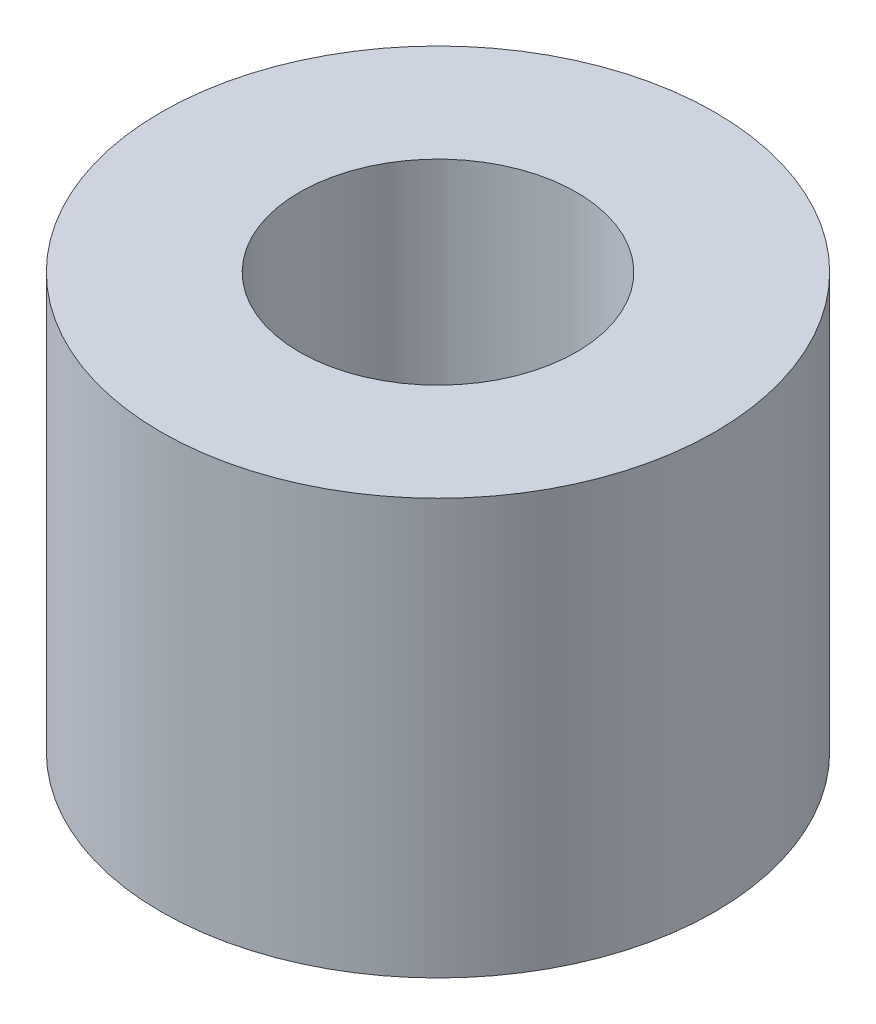
ISO-10303-21;
HEADER;
FILE_DESCRIPTION(('STEP AP214'),'2;1');
FILE_NAME('part.step','',(''),(''),'','','');
FILE_SCHEMA(('AUTOMOTIVE_DESIGN { 1 0 10303 214 1 1 1 1 }'));
ENDSEC;
DATA;
#1=APPLICATION_CONTEXT('core data for automotive mechanical design processes');
#2=APPLICATION_PROTOCOL_DEFINITION('international standard','automotive_design',2000,#1);
#3=PRODUCT_CONTEXT('',#1,'mechanical');
#4=PRODUCT('Part','Part','',(#3));
#5=PRODUCT_RELATED_PRODUCT_CATEGORY('part','',(#4));
#6=PRODUCT_DEFINITION_FORMATION('','',#4);
#7=PRODUCT_DEFINITION_CONTEXT('part definition',#1,'design');
#8=PRODUCT_DEFINITION('design','',#6,#7);
#9=PRODUCT_DEFINITION_SHAPE('','',#8);
#10=(LENGTH_UNIT() NAMED_UNIT(*) SI_UNIT(.MILLI.,.METRE.));
#11=(NAMED_UNIT(*) PLANE_ANGLE_UNIT() SI_UNIT($,.RADIAN.));
#12=(NAMED_UNIT(*) SI_UNIT($,.STERADIAN.) SOLID_ANGLE_UNIT());
#13=UNCERTAINTY_MEASURE_WITH_UNIT(LENGTH_MEASURE(1.E-05),#10,'distance_accuracy_value','');
#14=(GEOMETRIC_REPRESENTATION_CONTEXT(3) GLOBAL_UNCERTAINTY_ASSIGNED_CONTEXT((#13)) GLOBAL_UNIT_ASSIGNED_CONTEXT((#10,
#11,#12)) REPRESENTATION_CONTEXT('',''));
#15=CARTESIAN_POINT('',(0.,0.,0.));
#16=DIRECTION('',(0.,0.,1.));
#17=DIRECTION('',(1.,0.,0.));
#18=AXIS2_PLACEMENT_3D('',#15,#16,#17);
#19=CARTESIAN_POINT('',(0.,4.7625,0.));
#20=DIRECTION('',(0.,1.,0.));
#21=DIRECTION('',(0.,0.,1.));
#22=AXIS2_PLACEMENT_3D('',#19,#20,#21);
#23=PLANE('',#22);
#24=CARTESIAN_POINT('',(0.,4.7625,0.));
#25=DIRECTION('',(0.,1.,0.));
#26=DIRECTION('',(0.,0.,1.));
#27=AXIS2_PLACEMENT_3D('',#24,#25,#26);
#28=CIRCLE('',#27,6.35);
#29=CARTESIAN_POINT('',(0.,4.7625,6.35));
#30=VERTEX_POINT('',#29);
#31=EDGE_CURVE('E10',#30,#30,#28,.T.);
#32=ORIENTED_EDGE('',*,*,#31,.T.);
#33=EDGE_LOOP('',(#32));
#34=FACE_BOUND('',#33,.T.);
#35=CARTESIAN_POINT('',(0.,4.7625,0.));
#36=DIRECTION('',(0.,1.,0.));
#37=DIRECTION('',(0.,0.,1.));
#38=AXIS2_PLACEMENT_3D('',#35,#36,#37);
#39=CIRCLE('',#38,3.175);
#40=CARTESIAN_POINT('',(0.,4.7625,3.175));
#41=VERTEX_POINT('',#40);
#42=EDGE_CURVE('E42',#41,#41,#39,.T.);
#43=ORIENTED_EDGE('',*,*,#42,.F.);
#44=EDGE_LOOP('',(#43));
#45=FACE_BOUND('',#44,.T.);
#46=ADVANCED_FACE('F31',(#34,#45),#23,.T.);
#47=CARTESIAN_POINT('',(0.,-4.7625,0.));
#48=DIRECTION('',(0.,1.,0.));
#49=DIRECTION('',(0.,0.,1.));
#50=AXIS2_PLACEMENT_3D('',#47,#48,#49);
#51=PLANE('',#50);
#52=CARTESIAN_POINT('',(0.,-4.7625,0.));
#53=DIRECTION('',(0.,1.,0.));
#54=DIRECTION('',(0.,0.,1.));
#55=AXIS2_PLACEMENT_3D('',#52,#53,#54);
#56=CIRCLE('',#55,6.35);
#57=CARTESIAN_POINT('',(0.,-4.7625,6.35));
#58=VERTEX_POINT('',#57);
#59=EDGE_CURVE('E35',#58,#58,#56,.T.);
#60=ORIENTED_EDGE('',*,*,#59,.F.);
#61=EDGE_LOOP('',(#60));
#62=FACE_BOUND('',#61,.T.);
#63=CARTESIAN_POINT('',(0.,-4.7625,0.));
#64=DIRECTION('',(0.,1.,0.));
#65=DIRECTION('',(0.,0.,1.));
#66=AXIS2_PLACEMENT_3D('',#63,#64,#65);
#67=CIRCLE('',#66,3.175);
#68=CARTESIAN_POINT('',(0.,-4.7625,3.175));
#69=VERTEX_POINT('',#68);
#70=EDGE_CURVE('E44',#69,#69,#67,.T.);
#71=ORIENTED_EDGE('',*,*,#70,.T.);
#72=EDGE_LOOP('',(#71));
#73=FACE_BOUND('',#72,.T.);
#74=ADVANCED_FACE('F54',(#62,#73),#51,.F.);
#75=CARTESIAN_POINT('',(0.,4.7625,0.));
#76=DIRECTION('',(0.,-1.,0.));
#77=DIRECTION('',(0.,0.,-1.));
#78=AXIS2_PLACEMENT_3D('',#75,#76,#77);
#79=CYLINDRICAL_SURFACE('',#78,6.35);
#80=ORIENTED_EDGE('',*,*,#31,.F.);
#81=EDGE_LOOP('',(#80));
#82=FACE_BOUND('',#81,.T.);
#83=ORIENTED_EDGE('',*,*,#59,.T.);
#84=EDGE_LOOP('',(#83));
#85=FACE_BOUND('',#84,.T.);
#86=ADVANCED_FACE('F33',(#82,#85),#79,.T.);
#87=CARTESIAN_POINT('',(0.,4.7625,0.));
#88=DIRECTION('',(0.,-1.,0.));
#89=DIRECTION('',(0.,0.,-1.));
#90=AXIS2_PLACEMENT_3D('',#87,#88,#89);
#91=CYLINDRICAL_SURFACE('',#90,3.175);
#92=ORIENTED_EDGE('',*,*,#42,.T.);
#93=EDGE_LOOP('',(#92));
#94=FACE_BOUND('',#93,.T.);
#95=ORIENTED_EDGE('',*,*,#70,.F.);
#96=EDGE_LOOP('',(#95));
#97=FACE_BOUND('',#96,.T.);
#98=ADVANCED_FACE('F50',(#94,#97),#91,.F.);
#99=CLOSED_SHELL('',(#46,#74,#86,#98));
#100=MANIFOLD_SOLID_BREP('B2',#99);
#101=ADVANCED_BREP_SHAPE_REPRESENTATION('',(#18,#100),#14);
#102=SHAPE_DEFINITION_REPRESENTATION(#9,#101);
ENDSEC;
END-ISO-10303-21;
